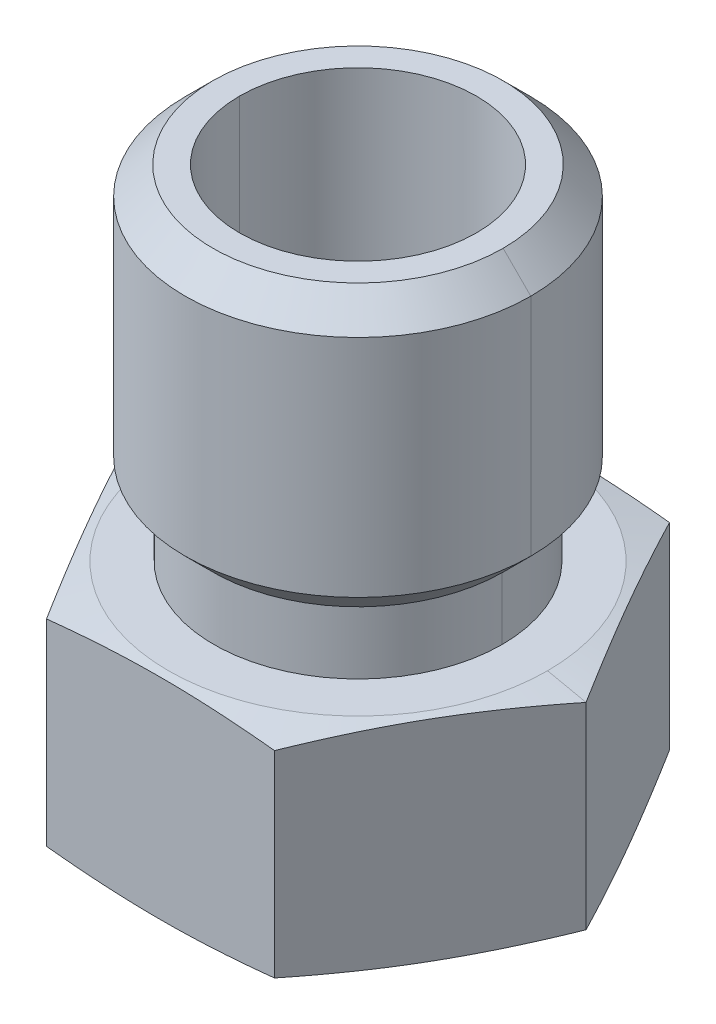
ISO-10303-21;
HEADER;
FILE_DESCRIPTION(('STEP AP214'),'2;1');
FILE_NAME('part.step','',(''),(''),'','','');
FILE_SCHEMA(('AUTOMOTIVE_DESIGN { 1 0 10303 214 1 1 1 1 }'));
ENDSEC;
DATA;
#1=APPLICATION_CONTEXT('core data for automotive mechanical design processes');
#2=APPLICATION_PROTOCOL_DEFINITION('international standard','automotive_design',2000,#1);
#3=PRODUCT_CONTEXT('',#1,'mechanical');
#4=PRODUCT('Part','Part','',(#3));
#5=PRODUCT_RELATED_PRODUCT_CATEGORY('part','',(#4));
#6=PRODUCT_DEFINITION_FORMATION('','',#4);
#7=PRODUCT_DEFINITION_CONTEXT('part definition',#1,'design');
#8=PRODUCT_DEFINITION('design','',#6,#7);
#9=PRODUCT_DEFINITION_SHAPE('','',#8);
#10=(LENGTH_UNIT() NAMED_UNIT(*) SI_UNIT(.MILLI.,.METRE.));
#11=(NAMED_UNIT(*) PLANE_ANGLE_UNIT() SI_UNIT($,.RADIAN.));
#12=(NAMED_UNIT(*) SI_UNIT($,.STERADIAN.) SOLID_ANGLE_UNIT());
#13=UNCERTAINTY_MEASURE_WITH_UNIT(LENGTH_MEASURE(1.E-05),#10,'distance_accuracy_value','');
#14=(GEOMETRIC_REPRESENTATION_CONTEXT(3) GLOBAL_UNCERTAINTY_ASSIGNED_CONTEXT((#13)) GLOBAL_UNIT_ASSIGNED_CONTEXT((#10,
#11,#12)) REPRESENTATION_CONTEXT('',''));
#15=CARTESIAN_POINT('',(0.,0.,0.));
#16=DIRECTION('',(0.,0.,1.));
#17=DIRECTION('',(1.,0.,0.));
#18=AXIS2_PLACEMENT_3D('',#15,#16,#17);
#19=CARTESIAN_POINT('',(0.,0.,0.));
#20=DIRECTION('',(0.,1.,0.));
#21=DIRECTION('',(0.,0.,1.));
#22=AXIS2_PLACEMENT_3D('',#19,#20,#21);
#23=PLANE('',#22);
#24=CARTESIAN_POINT('',(0.,0.,0.));
#25=DIRECTION('',(0.,1.,0.));
#26=DIRECTION('',(0.,0.,1.));
#27=AXIS2_PLACEMENT_3D('',#24,#25,#26);
#28=CIRCLE('',#27,6.09600000001365);
#29=CARTESIAN_POINT('',(6.09600000001365,0.,0.));
#30=VERTEX_POINT('',#29);
#31=CARTESIAN_POINT('',(-6.09600000001365,0.,0.));
#32=VERTEX_POINT('',#31);
#33=EDGE_CURVE('E146',#30,#32,#28,.T.);
#34=ORIENTED_EDGE('',*,*,#33,.F.);
#35=CARTESIAN_POINT('',(0.,0.,0.));
#36=DIRECTION('',(0.,1.,0.));
#37=DIRECTION('',(0.,0.,1.));
#38=AXIS2_PLACEMENT_3D('',#35,#36,#37);
#39=CIRCLE('',#38,6.09600000001365);
#40=EDGE_CURVE('E20',#32,#30,#39,.T.);
#41=ORIENTED_EDGE('',*,*,#40,.F.);
#42=EDGE_LOOP('',(#34,#41));
#43=FACE_BOUND('',#42,.T.);
#44=ADVANCED_FACE('F17',(#43),#23,.F.);
#45=CARTESIAN_POINT('',(0.,0.264370732722341,0.));
#46=DIRECTION('',(0.,1.,0.));
#47=DIRECTION('',(0.,0.,1.));
#48=AXIS2_PLACEMENT_3D('',#45,#46,#47);
#49=CONICAL_SURFACE('',#48,7.33976650923296,1.36135681655376);
#50=DIRECTION('',(0.978147600733752,-0.207911690818011,0.));
#51=VECTOR('',#50,1.);
#52=CARTESIAN_POINT('',(-499000.,106064.428528675,-6.11098752774529E-11));
#53=LINE('',#52,#51);
#54=CARTESIAN_POINT('',(-7.3323484187056,0.26279396890061,0.));
#55=VERTEX_POINT('',#54);
#56=EDGE_CURVE('E144',#32,#55,#53,.F.);
#57=ORIENTED_EDGE('',*,*,#56,.F.);
#58=ORIENTED_EDGE('',*,*,#40,.T.);
#59=DIRECTION('',(-0.978147600733752,-0.207911690818011,0.));
#60=VECTOR('',#59,1.);
#61=CARTESIAN_POINT('',(499000.,106064.428528675,0.));
#62=LINE('',#61,#60);
#63=CARTESIAN_POINT('',(7.33234841870554,0.26279396890061,0.));
#64=VERTEX_POINT('',#63);
#65=EDGE_CURVE('E141',#64,#30,#62,.T.);
#66=ORIENTED_EDGE('',*,*,#65,.F.);
#67=CARTESIAN_POINT('',(3.66617420935393,0.262793968906226,6.35000000000005));
#68=CARTESIAN_POINT('',(3.81860909044665,0.230380057867881,6.08597504110175));
#69=CARTESIAN_POINT('',(3.97121898596925,0.200980135804144,5.82164694831884));
#70=CARTESIAN_POINT('',(4.27677822478303,0.149358848003368,5.29240282197133));
#71=CARTESIAN_POINT('',(4.42972764347914,0.127139280960557,5.02748665780154));
#72=CARTESIAN_POINT('',(4.73538036004834,0.091105451516797,4.49808062323226));
#73=CARTESIAN_POINT('',(4.88808283674924,0.0772640455212066,4.23359217514473));
#74=CARTESIAN_POINT('',(5.19361065816769,0.0587065460036978,3.70440246532216));
#75=CARTESIAN_POINT('',(5.34643598609972,0.0539893666617372,3.43970123266052));
#76=CARTESIAN_POINT('',(5.65208664196379,0.0539893666617655,2.91029876733723));
#77=CARTESIAN_POINT('',(5.80491196989582,0.0587065460037544,2.64559753467558));
#78=CARTESIAN_POINT('',(6.11043979131427,0.0772640455213181,2.11640782485302));
#79=CARTESIAN_POINT('',(6.26314226801516,0.091105451516935,1.85191937676548));
#80=CARTESIAN_POINT('',(6.56879498458436,0.127139280960745,1.32251334219621));
#81=CARTESIAN_POINT('',(6.72174440328047,0.149358848003579,1.05759717802642));
#82=CARTESIAN_POINT('',(7.02730364209425,0.200980135804399,0.528353051678914));
#83=CARTESIAN_POINT('',(7.17991353761685,0.230380057868155,0.264024958896007));
#84=CARTESIAN_POINT('',(7.33234841870957,0.262793968906519,-2.29595956689995E-12));
#85=B_SPLINE_CURVE_WITH_KNOTS('',3,(#67,#68,#69,#70,#71,#72,#73,#74,#75,#76,#77,#78,#79,#80,#81,
#82,#83,#84),.UNSPECIFIED.,.F.,.F.,(4,2,2,2,2,2,2,2,4),(0.,0.919793548057206,1.83981732806981,
2.75684423159208,3.6737619984713,4.59067976535052,5.50770666887279,6.42773044888539,
7.3475239969426),.UNSPECIFIED.);
#86=CARTESIAN_POINT('',(3.66617420935398,0.262793968906227,6.35000000000003));
#87=VERTEX_POINT('',#86);
#88=EDGE_CURVE('E271',#87,#64,#85,.T.);
#89=ORIENTED_EDGE('',*,*,#88,.F.);
#90=CARTESIAN_POINT('',(-3.66617420935393,0.262793968906216,6.35));
#91=CARTESIAN_POINT('',(-3.36130444716862,0.230380057867886,6.35));
#92=CARTESIAN_POINT('',(-3.05608465612356,0.200980135804163,6.35));
#93=CARTESIAN_POINT('',(-2.44496617849628,0.149358848003406,6.35));
#94=CARTESIAN_POINT('',(-2.13906734110419,0.127139280960602,6.35));
#95=CARTESIAN_POINT('',(-1.52776190796608,0.0911054515168472,6.35));
#96=CARTESIAN_POINT('',(-1.22235695456443,0.0772640455212557,6.35));
#97=CARTESIAN_POINT('',(-0.611301311727807,0.0587065460037361,6.35));
#98=CARTESIAN_POINT('',(-0.305650655863879,0.0539893666617659,6.35));
#99=CARTESIAN_POINT('',(0.305650655863977,0.0539893666617669,6.35));
#100=CARTESIAN_POINT('',(0.611301311727905,0.0587065460037381,6.35));
#101=CARTESIAN_POINT('',(1.22235695456453,0.0772640455212596,6.35));
#102=CARTESIAN_POINT('',(1.52776190796617,0.0911054515168521,6.35));
#103=CARTESIAN_POINT('',(2.13906734110429,0.127139280960608,6.35));
#104=CARTESIAN_POINT('',(2.44496617849638,0.149358848003413,6.35));
#105=CARTESIAN_POINT('',(3.05608465612366,0.200980135804171,6.35));
#106=CARTESIAN_POINT('',(3.36130444716872,0.230380057867896,6.35));
#107=CARTESIAN_POINT('',(3.66617420935402,0.262793968906227,6.35));
#108=B_SPLINE_CURVE_WITH_KNOTS('',3,(#90,#91,#92,#93,#94,#95,#96,#97,#98,#99,#100,#101,#102,
#103,#104,#105,#106,#107),.UNSPECIFIED.,.F.,.F.,(4,2,2,2,2,2,2,2,4),(0.,0.919793548056815,
1.83981732806903,2.75684423159091,3.67376199846974,4.59067976534857,5.50770666887046,
6.42773044888267,7.34752399693949),.UNSPECIFIED.);
#109=CARTESIAN_POINT('',(-3.6661742093538,0.262793968906196,6.34999999999996));
#110=VERTEX_POINT('',#109);
#111=EDGE_CURVE('E329',#110,#87,#108,.T.);
#112=ORIENTED_EDGE('',*,*,#111,.F.);
#113=CARTESIAN_POINT('',(-7.33234841870939,0.26279396890648,-2.54832020853691E-12));
#114=CARTESIAN_POINT('',(-7.17991353761667,0.230380057868114,0.26402495889576));
#115=CARTESIAN_POINT('',(-7.02730364209406,0.200980135804356,0.528353051678673));
#116=CARTESIAN_POINT('',(-6.72174440328028,0.149358848003531,1.05759717802619));
#117=CARTESIAN_POINT('',(-6.56879498458417,0.127139280960695,1.32251334219598));
#118=CARTESIAN_POINT('',(-6.26314226801496,0.0911054515168808,1.85191937676526));
#119=CARTESIAN_POINT('',(-6.11043979131407,0.0772640455212621,2.1164078248528));
#120=CARTESIAN_POINT('',(-5.80491196989561,0.0587065460036958,2.64559753467538));
#121=CARTESIAN_POINT('',(-5.65208664196358,0.0539893666617059,2.91029876733703));
#122=CARTESIAN_POINT('',(-5.3464359860995,0.0539893666616763,3.43970123266033));
#123=CARTESIAN_POINT('',(-5.19361065816747,0.0587065460036367,3.70440246532198));
#124=CARTESIAN_POINT('',(-4.88808283674901,0.0772640455211458,4.23359217514455));
#125=CARTESIAN_POINT('',(-4.73538036004811,0.0911054515167367,4.4980806232321));
#126=CARTESIAN_POINT('',(-4.42972764347891,0.127139280960498,5.02748665780138));
#127=CARTESIAN_POINT('',(-4.27677822478279,0.14935884800331,5.29240282197117));
#128=CARTESIAN_POINT('',(-3.97121898596901,0.200980135804089,5.82164694831869));
#129=CARTESIAN_POINT('',(-3.81860909044641,0.230380057867828,6.08597504110161));
#130=CARTESIAN_POINT('',(-3.66617420935368,0.262793968906175,6.34999999999992));
#131=B_SPLINE_CURVE_WITH_KNOTS('',3,(#113,#114,#115,#116,#117,#118,#119,#120,#121,#122,#123,
#124,#125,#126,#127,#128,#129,#130),.UNSPECIFIED.,.F.,.F.,(4,2,2,2,2,2,2,2,4),(0.,
0.919793548057223,1.83981732806984,2.75684423159213,3.67376199847137,4.5906797653506,
5.50770666887289,6.42773044888551,7.34752399694273),.UNSPECIFIED.);
#132=EDGE_CURVE('E148',#55,#110,#131,.T.);
#133=ORIENTED_EDGE('',*,*,#132,.F.);
#134=EDGE_LOOP('',(#57,#58,#66,#89,#112,#133));
#135=FACE_BOUND('',#134,.T.);
#136=ADVANCED_FACE('F138',(#135),#49,.T.);
#137=CARTESIAN_POINT('',(0.,0.264370732722341,0.));
#138=DIRECTION('',(0.,1.,0.));
#139=DIRECTION('',(0.,0.,1.));
#140=AXIS2_PLACEMENT_3D('',#137,#138,#139);
#141=CONICAL_SURFACE('',#140,7.33976650923296,1.36135681655376);
#142=ORIENTED_EDGE('',*,*,#65,.T.);
#143=ORIENTED_EDGE('',*,*,#33,.T.);
#144=ORIENTED_EDGE('',*,*,#56,.T.);
#145=CARTESIAN_POINT('',(-3.66617420935393,0.262793968906227,-6.35000000000006));
#146=CARTESIAN_POINT('',(-3.81860909044665,0.230380057867881,-6.08597504110175));
#147=CARTESIAN_POINT('',(-3.97121898596925,0.200980135804144,-5.82164694831884));
#148=CARTESIAN_POINT('',(-4.27677822478303,0.149358848003368,-5.29240282197133));
#149=CARTESIAN_POINT('',(-4.42972764347914,0.127139280960557,-5.02748665780154));
#150=CARTESIAN_POINT('',(-4.73538036004834,0.0911054515167971,-4.49808062323227));
#151=CARTESIAN_POINT('',(-4.88808283674923,0.0772640455212065,-4.23359217514473));
#152=CARTESIAN_POINT('',(-5.19361065816769,0.0587065460036977,-3.70440246532216));
#153=CARTESIAN_POINT('',(-5.34643598609972,0.0539893666617373,-3.43970123266052));
#154=CARTESIAN_POINT('',(-5.65208664196379,0.0539893666617656,-2.91029876733723));
#155=CARTESIAN_POINT('',(-5.80491196989582,0.0587065460037543,-2.64559753467558));
#156=CARTESIAN_POINT('',(-6.11043979131427,0.0772640455213179,-2.11640782485302));
#157=CARTESIAN_POINT('',(-6.26314226801516,0.0911054515169349,-1.85191937676548));
#158=CARTESIAN_POINT('',(-6.56879498458436,0.127139280960745,-1.32251334219621));
#159=CARTESIAN_POINT('',(-6.72174440328047,0.149358848003579,-1.05759717802643));
#160=CARTESIAN_POINT('',(-7.02730364209425,0.200980135804399,-0.528353051678916));
#161=CARTESIAN_POINT('',(-7.17991353761685,0.230380057868155,-0.264024958896009));
#162=CARTESIAN_POINT('',(-7.33234841870957,0.262793968906519,2.29488033074503E-12));
#163=B_SPLINE_CURVE_WITH_KNOTS('',3,(#145,#146,#147,#148,#149,#150,#151,#152,#153,#154,#155,
#156,#157,#158,#159,#160,#161,#162),.UNSPECIFIED.,.F.,.F.,(4,2,2,2,2,2,2,2,4),(0.,
0.919793548057207,1.83981732806981,2.75684423159208,3.6737619984713,4.59067976535052,
5.50770666887279,6.42773044888539,7.3475239969426),.UNSPECIFIED.);
#164=CARTESIAN_POINT('',(-3.66617420935398,0.262793968906227,-6.35000000000003));
#165=VERTEX_POINT('',#164);
#166=EDGE_CURVE('E240',#165,#55,#163,.T.);
#167=ORIENTED_EDGE('',*,*,#166,.F.);
#168=CARTESIAN_POINT('',(3.66617420935393,0.262793968906216,-6.35));
#169=CARTESIAN_POINT('',(3.36130444716862,0.230380057867886,-6.35));
#170=CARTESIAN_POINT('',(3.05608465612356,0.200980135804163,-6.35));
#171=CARTESIAN_POINT('',(2.44496617849628,0.149358848003406,-6.35));
#172=CARTESIAN_POINT('',(2.13906734110419,0.127139280960602,-6.35));
#173=CARTESIAN_POINT('',(1.52776190796608,0.0911054515168472,-6.35));
#174=CARTESIAN_POINT('',(1.22235695456443,0.0772640455212557,-6.35));
#175=CARTESIAN_POINT('',(0.611301311727807,0.0587065460037361,-6.35));
#176=CARTESIAN_POINT('',(0.305650655863879,0.0539893666617659,-6.35));
#177=CARTESIAN_POINT('',(-0.305650655863977,0.0539893666617669,-6.35));
#178=CARTESIAN_POINT('',(-0.611301311727905,0.0587065460037381,-6.35));
#179=CARTESIAN_POINT('',(-1.22235695456453,0.0772640455212596,-6.35));
#180=CARTESIAN_POINT('',(-1.52776190796617,0.0911054515168521,-6.35));
#181=CARTESIAN_POINT('',(-2.13906734110429,0.127139280960608,-6.35));
#182=CARTESIAN_POINT('',(-2.44496617849638,0.149358848003413,-6.35));
#183=CARTESIAN_POINT('',(-3.05608465612366,0.200980135804171,-6.35));
#184=CARTESIAN_POINT('',(-3.36130444716872,0.230380057867896,-6.35));
#185=CARTESIAN_POINT('',(-3.66617420935402,0.262793968906227,-6.35));
#186=B_SPLINE_CURVE_WITH_KNOTS('',3,(#168,#169,#170,#171,#172,#173,#174,#175,#176,#177,#178,
#179,#180,#181,#182,#183,#184,#185),.UNSPECIFIED.,.F.,.F.,(4,2,2,2,2,2,2,2,4),(0.,
0.919793548056815,1.83981732806903,2.75684423159091,3.67376199846974,4.59067976534857,
5.50770666887046,6.42773044888267,7.34752399693949),.UNSPECIFIED.);
#187=CARTESIAN_POINT('',(3.6661742093538,0.262793968906196,-6.34999999999996));
#188=VERTEX_POINT('',#187);
#189=EDGE_CURVE('E252',#188,#165,#186,.T.);
#190=ORIENTED_EDGE('',*,*,#189,.F.);
#191=CARTESIAN_POINT('',(7.33234841870937,0.262793968906476,2.51239042590781E-12));
#192=CARTESIAN_POINT('',(7.17991353761665,0.23038005786811,-0.264024958895795));
#193=CARTESIAN_POINT('',(7.02730364209405,0.200980135804352,-0.528353051678706));
#194=CARTESIAN_POINT('',(6.72174440328027,0.149358848003528,-1.05759717802622));
#195=CARTESIAN_POINT('',(6.56879498458415,0.127139280960692,-1.32251334219601));
#196=CARTESIAN_POINT('',(6.26314226801495,0.0911054515168794,-1.85191937676529));
#197=CARTESIAN_POINT('',(6.11043979131406,0.0772640455212611,-2.11640782485283));
#198=CARTESIAN_POINT('',(5.8049119698956,0.0587065460036954,-2.6455975346754));
#199=CARTESIAN_POINT('',(5.65208664196357,0.0539893666617059,-2.91029876733705));
#200=CARTESIAN_POINT('',(5.34643598609949,0.0539893666616767,-3.43970123266034));
#201=CARTESIAN_POINT('',(5.19361065816746,0.058706546003637,-3.70440246532199));
#202=CARTESIAN_POINT('',(4.888082836749,0.0772640455211462,-4.23359217514457));
#203=CARTESIAN_POINT('',(4.73538036004811,0.0911054515167373,-4.49808062323211));
#204=CARTESIAN_POINT('',(4.42972764347891,0.127139280960499,-5.02748665780139));
#205=CARTESIAN_POINT('',(4.27677822478279,0.149358848003311,-5.29240282197118));
#206=CARTESIAN_POINT('',(3.97121898596901,0.20098013580409,-5.8216469483187));
#207=CARTESIAN_POINT('',(3.8186090904464,0.230380057867828,-6.08597504110161));
#208=CARTESIAN_POINT('',(3.66617420935368,0.262793968906175,-6.34999999999992));
#209=B_SPLINE_CURVE_WITH_KNOTS('',3,(#191,#192,#193,#194,#195,#196,#197,#198,#199,#200,#201,
#202,#203,#204,#205,#206,#207,#208),.UNSPECIFIED.,.F.,.F.,(4,2,2,2,2,2,2,2,4),(0.,
0.919793548057218,1.83981732806983,2.75684423159212,3.67376199847134,4.59067976535057,
5.50770666887286,6.42773044888547,7.3475239969427),.UNSPECIFIED.);
#210=EDGE_CURVE('E152',#64,#188,#209,.T.);
#211=ORIENTED_EDGE('',*,*,#210,.F.);
#212=EDGE_LOOP('',(#142,#143,#144,#167,#190,#211));
#213=FACE_BOUND('',#212,.T.);
#214=ADVANCED_FACE('F150',(#213),#141,.T.);
#215=CARTESIAN_POINT('',(0.,6.731,0.));
#216=DIRECTION('',(0.,-1.,0.));
#217=DIRECTION('',(0.,0.,-1.));
#218=AXIS2_PLACEMENT_3D('',#215,#216,#217);
#219=PLANE('',#218);
#220=CARTESIAN_POINT('',(0.,6.731,0.));
#221=DIRECTION('',(0.,-1.,0.));
#222=DIRECTION('',(0.,0.,-1.));
#223=AXIS2_PLACEMENT_3D('',#220,#221,#222);
#224=CIRCLE('',#223,2.54);
#225=CARTESIAN_POINT('',(-2.54,6.731,0.));
#226=VERTEX_POINT('',#225);
#227=CARTESIAN_POINT('',(2.54,6.731,0.));
#228=VERTEX_POINT('',#227);
#229=EDGE_CURVE('E250',#226,#228,#224,.F.);
#230=ORIENTED_EDGE('',*,*,#229,.T.);
#231=CARTESIAN_POINT('',(0.,6.731,0.));
#232=DIRECTION('',(0.,-1.,0.));
#233=DIRECTION('',(0.,0.,-1.));
#234=AXIS2_PLACEMENT_3D('',#231,#232,#233);
#235=CIRCLE('',#234,2.54);
#236=EDGE_CURVE('E316',#228,#226,#235,.F.);
#237=ORIENTED_EDGE('',*,*,#236,.T.);
#238=EDGE_LOOP('',(#230,#237));
#239=FACE_BOUND('',#238,.T.);
#240=ADVANCED_FACE('F260',(#239),#219,.F.);
#241=CARTESIAN_POINT('',(-7.33234841870792,0.,0.));
#242=DIRECTION('',(-0.866025403784429,0.,0.500000000000017));
#243=DIRECTION('',(0.500000000000017,0.,0.866025403784429));
#244=AXIS2_PLACEMENT_3D('',#241,#242,#243);
#245=PLANE('',#244);
#246=DIRECTION('',(0.,1.,0.));
#247=VECTOR('',#246,1.);
#248=CARTESIAN_POINT('',(-3.66617420935396,0.,6.35));
#249=LINE('',#248,#247);
#250=CARTESIAN_POINT('',(-3.66617423298878,6.59520602859016,6.35));
#251=VERTEX_POINT('',#250);
#252=EDGE_CURVE('E328',#251,#110,#249,.F.);
#253=ORIENTED_EDGE('',*,*,#252,.F.);
#254=CARTESIAN_POINT('',(-7.33234841870765,6.59520603110214,4.57986680926984E-13));
#255=CARTESIAN_POINT('',(-7.17991353966322,6.62761994170392,0.264024955351029));
#256=CARTESIAN_POINT('',(-7.02730364619408,6.65701986341339,0.52835304457723));
#257=CARTESIAN_POINT('',(-6.72174441149638,6.70864115071417,1.0575971637955));
#258=CARTESIAN_POINT('',(-6.56879499486288,6.73086071761135,1.32251332439273));
#259=CARTESIAN_POINT('',(-6.26314228240563,6.76689454701844,1.85191935183991));
#260=CARTESIAN_POINT('',(-6.11043980775404,6.78073595312156,2.11640779637794));
#261=CARTESIAN_POINT('',(-5.80491199043189,6.79929345312371,2.6455974991055));
#262=CARTESIAN_POINT('',(-5.65208666454685,6.80401063284272,2.91029872822164));
#263=CARTESIAN_POINT('',(-5.34643601276322,6.80401063385039,3.43970118647741));
#264=CARTESIAN_POINT('',(-5.19361068686462,6.79929345513872,3.70440241561705));
#265=CARTESIAN_POINT('',(-4.88808286950178,6.78073595708601,4.23359211841509));
#266=CARTESIAN_POINT('',(-4.73538039482306,6.76689455192502,4.49808056300012));
#267=CARTESIAN_POINT('',(-4.42972768230323,6.7308607242934,5.0274865905557));
#268=CARTESIAN_POINT('',(-4.27677826563424,6.70864115822925,5.29240275121439));
#269=CARTESIAN_POINT('',(-3.97121903086039,6.65701987246774,5.82164687056454));
#270=CARTESIAN_POINT('',(-3.81860913735061,6.62761995146447,6.08597495986115));
#271=CARTESIAN_POINT('',(-3.66617425826617,6.59520604149874,6.34999991528101));
#272=B_SPLINE_CURVE_WITH_KNOTS('',3,(#254,#255,#256,#257,#258,#259,#260,#261,#262,#263,#264,
#265,#266,#267,#268,#269,#270,#271),.UNSPECIFIED.,.F.,.F.,(4,2,2,2,2,2,2,2,4),(0.,
0.919793535696101,1.83981730333802,2.75684419459774,3.67376194922013,4.59067970387622,
5.50770659516791,6.42773036283809,7.34752389857076),.UNSPECIFIED.);
#273=CARTESIAN_POINT('',(-7.3323484187056,6.59520603110491,0.));
#274=VERTEX_POINT('',#273);
#275=EDGE_CURVE('E310',#274,#251,#272,.T.);
#276=ORIENTED_EDGE('',*,*,#275,.F.);
#277=DIRECTION('',(0.,1.,0.));
#278=VECTOR('',#277,1.);
#279=CARTESIAN_POINT('',(-7.33234841870817,0.,-1.40512601554121E-13));
#280=LINE('',#279,#278);
#281=EDGE_CURVE('E248',#55,#274,#280,.T.);
#282=ORIENTED_EDGE('',*,*,#281,.F.);
#283=ORIENTED_EDGE('',*,*,#132,.T.);
#284=EDGE_LOOP('',(#253,#276,#282,#283));
#285=FACE_BOUND('',#284,.T.);
#286=ADVANCED_FACE('F317',(#285),#245,.T.);
#287=CARTESIAN_POINT('',(-3.66617420935396,0.,6.35));
#288=DIRECTION('',(0.,0.,1.));
#289=DIRECTION('',(1.,0.,0.));
#290=AXIS2_PLACEMENT_3D('',#287,#288,#289);
#291=PLANE('',#290);
#292=DIRECTION('',(0.,1.,0.));
#293=VECTOR('',#292,1.);
#294=CARTESIAN_POINT('',(3.66617420935396,0.,6.35));
#295=LINE('',#294,#293);
#296=CARTESIAN_POINT('',(3.66617419753657,6.59520602859016,6.35000002046833));
#297=VERTEX_POINT('',#296);
#298=EDGE_CURVE('E333',#297,#87,#295,.F.);
#299=ORIENTED_EDGE('',*,*,#298,.F.);
#300=CARTESIAN_POINT('',(-3.66617425662359,6.59520602607829,6.35));
#301=CARTESIAN_POINT('',(-3.36130449659395,6.62761993719836,6.35));
#302=CARTESIAN_POINT('',(-3.05608470771054,6.65701985942026,6.35));
#303=CARTESIAN_POINT('',(-2.44496623441101,6.70864114770643,6.35));
#304=CARTESIAN_POINT('',(-2.13906739918502,6.7308607150765,6.35));
#305=CARTESIAN_POINT('',(-1.52776197035729,6.76689454535923,6.35));
#306=CARTESIAN_POINT('',(-1.22235701909993,6.78073595186564,6.35));
#307=CARTESIAN_POINT('',(-0.611301380536359,6.79929345257561,6.35));
#308=CARTESIAN_POINT('',(-0.305650726801214,6.80401063259918,6.35));
#309=CARTESIAN_POINT('',(0.30565058070931,6.80401063409378,6.35));
#310=CARTESIAN_POINT('',(0.61130123448469,6.7992934555643,6.35));
#311=CARTESIAN_POINT('',(1.22235687316897,6.78073595774577,6.35));
#312=CARTESIAN_POINT('',(1.52776182450682,6.76689455263674,6.35));
#313=CARTESIAN_POINT('',(2.13906725352021,6.73086072498741,6.35));
#314=CARTESIAN_POINT('',(2.44496608885145,6.70864115885289,6.35));
#315=CARTESIAN_POINT('',(3.05608456237684,6.65701987284979,6.35));
#316=CARTESIAN_POINT('',(3.36130435138085,6.62761995167535,6.35));
#317=CARTESIAN_POINT('',(3.66617411152915,6.59520604149868,6.35));
#318=B_SPLINE_CURVE_WITH_KNOTS('',3,(#300,#301,#302,#303,#304,#305,#306,#307,#308,#309,#310,
#311,#312,#313,#314,#315,#316,#317),.UNSPECIFIED.,.F.,.F.,(4,2,2,2,2,2,2,2,4),(0.,
0.919793541651234,1.83981731525694,2.75684421242639,3.67376197295492,4.59067973353343,
5.50770663075031,6.42773040439792,7.3475239461034),.UNSPECIFIED.);
#319=EDGE_CURVE('E298',#251,#297,#318,.T.);
#320=ORIENTED_EDGE('',*,*,#319,.F.);
#321=ORIENTED_EDGE('',*,*,#252,.T.);
#322=ORIENTED_EDGE('',*,*,#111,.T.);
#323=EDGE_LOOP('',(#299,#320,#321,#322));
#324=FACE_BOUND('',#323,.T.);
#325=ADVANCED_FACE('F320',(#324),#291,.T.);
#326=CARTESIAN_POINT('',(3.66617420935396,0.,6.35));
#327=DIRECTION('',(0.866025403784429,0.,0.500000000000017));
#328=DIRECTION('',(0.500000000000017,0.,-0.866025403784429));
#329=AXIS2_PLACEMENT_3D('',#326,#327,#328);
#330=PLANE('',#329);
#331=DIRECTION('',(0.,1.,0.));
#332=VECTOR('',#331,1.);
#333=CARTESIAN_POINT('',(7.33234841870792,0.,0.));
#334=LINE('',#333,#332);
#335=CARTESIAN_POINT('',(7.33234841871646,6.59520603110216,-2.46759502394645E-13));
#336=VERTEX_POINT('',#335);
#337=EDGE_CURVE('E270',#336,#64,#334,.F.);
#338=ORIENTED_EDGE('',*,*,#337,.F.);
#339=CARTESIAN_POINT('',(3.66617418571917,6.5952060260783,6.35000004093666));
#340=CARTESIAN_POINT('',(3.8186090677822,6.62761993763491,6.08597508035773));
#341=CARTESIAN_POINT('',(3.9712189642773,6.65701986021106,5.82164698589041));
#342=CARTESIAN_POINT('',(4.27677820504298,6.70864114899719,5.2924028561621));
#343=CARTESIAN_POINT('',(4.42972762471851,6.73086071651289,5.02748669029592));
#344=CARTESIAN_POINT('',(4.73538034324416,6.76689454683228,4.49808065233796));
#345=CARTESIAN_POINT('',(4.88808282092207,6.78073595323116,4.23359220255818));
#346=CARTESIAN_POINT('',(5.19361064430001,6.7992934534565,3.70440248934169));
#347=CARTESIAN_POINT('',(5.3464359732145,6.80401063310303,3.43970125497837));
#348=CARTESIAN_POINT('',(5.65208663105004,6.80401063358996,2.91029878624038));
#349=CARTESIAN_POINT('',(5.80491195997109,6.79929345443018,2.64559755186571));
#350=CARTESIAN_POINT('',(6.11043978336869,6.78073595514685,2.11640783861517));
#351=CARTESIAN_POINT('',(6.26314226105971,6.76689454920322,1.85191938881268));
#352=CARTESIAN_POINT('',(6.56879497961561,6.73086071974175,1.32251335080233));
#353=CARTESIAN_POINT('',(6.72174439930828,6.70864115262859,1.05759718490646));
#354=CARTESIAN_POINT('',(7.02730364011076,6.65701986458625,0.528353055114429));
#355=CARTESIAN_POINT('',(7.1799135366255,6.62761994235136,0.264024960613082));
#356=CARTESIAN_POINT('',(7.33234841870786,6.59520603110209,6.747819950172E-13));
#357=B_SPLINE_CURVE_WITH_KNOTS('',3,(#339,#340,#341,#342,#343,#344,#345,#346,#347,#348,#349,
#350,#351,#352,#353,#354,#355,#356),.UNSPECIFIED.,.F.,.F.,(4,2,2,2,2,2,2,2,4),(0.,
0.919793554011846,1.83981733998773,2.75684424941925,3.67376202220412,4.59067979500526,
5.50770670445223,6.42773049044177,7.34752404447129),.UNSPECIFIED.);
#358=EDGE_CURVE('E292',#297,#336,#357,.T.);
#359=ORIENTED_EDGE('',*,*,#358,.F.);
#360=ORIENTED_EDGE('',*,*,#298,.T.);
#361=ORIENTED_EDGE('',*,*,#88,.T.);
#362=EDGE_LOOP('',(#338,#359,#360,#361));
#363=FACE_BOUND('',#362,.T.);
#364=ADVANCED_FACE('F280',(#363),#330,.T.);
#365=CARTESIAN_POINT('',(7.33234841870792,0.,0.));
#366=DIRECTION('',(0.866025403784429,0.,-0.500000000000017));
#367=DIRECTION('',(-0.500000000000017,0.,-0.866025403784429));
#368=AXIS2_PLACEMENT_3D('',#365,#366,#367);
#369=PLANE('',#368);
#370=DIRECTION('',(0.,1.,0.));
#371=VECTOR('',#370,1.);
#372=CARTESIAN_POINT('',(3.66617420935396,0.,-6.35));
#373=LINE('',#372,#371);
#374=CARTESIAN_POINT('',(3.66617423298286,6.59520602859079,-6.35));
#375=VERTEX_POINT('',#374);
#376=EDGE_CURVE('E269',#375,#188,#373,.F.);
#377=ORIENTED_EDGE('',*,*,#376,.F.);
#378=CARTESIAN_POINT('',(7.33234841870764,6.59520603110214,-4.9307002024208E-13));
#379=CARTESIAN_POINT('',(7.17991353966345,6.62761994170387,-0.264024955350633));
#380=CARTESIAN_POINT('',(7.02730364619456,6.6570198634133,-0.528353044576402));
#381=CARTESIAN_POINT('',(6.72174441149736,6.70864115071402,-1.0575971637938));
#382=CARTESIAN_POINT('',(6.5687949948641,6.73086071761118,-1.3225133243906));
#383=CARTESIAN_POINT('',(6.26314228240735,6.76689454701826,-1.85191935183691));
#384=CARTESIAN_POINT('',(6.11043980775601,6.78073595312139,-2.11640779637452));
#385=CARTESIAN_POINT('',(5.80491199043436,6.7992934531236,-2.64559749910122));
#386=CARTESIAN_POINT('',(5.65208666454958,6.80401063284266,-2.91029872821693));
#387=CARTESIAN_POINT('',(5.34643601276644,6.80401063385045,-3.43970118647184));
#388=CARTESIAN_POINT('',(5.19361068686809,6.79929345513886,-3.70440241561105));
#389=CARTESIAN_POINT('',(4.88808286950574,6.78073595708632,-4.23359211840824));
#390=CARTESIAN_POINT('',(4.73538039482726,6.76689455192543,-4.49808056299284));
#391=CARTESIAN_POINT('',(4.42972768230792,6.73086072429404,-5.02748659054757));
#392=CARTESIAN_POINT('',(4.27677826563918,6.70864115823,-5.29240275120583));
#393=CARTESIAN_POINT('',(3.97121903086582,6.65701987246874,-5.82164687055513));
#394=CARTESIAN_POINT('',(3.81860913735628,6.6276199514656,-6.08597495985132));
#395=CARTESIAN_POINT('',(3.66617425827209,6.5952060415,-6.34999991527075));
#396=B_SPLINE_CURVE_WITH_KNOTS('',3,(#378,#379,#380,#381,#382,#383,#384,#385,#386,#387,#388,
#389,#390,#391,#392,#393,#394,#395),.UNSPECIFIED.,.F.,.F.,(4,2,2,2,2,2,2,2,4),(0.,
0.919793535694599,1.83981730333502,2.75684419459325,3.67376194921415,4.59067970386876,
5.50770659515896,6.42773036282764,7.34752389855882),.UNSPECIFIED.);
#397=EDGE_CURVE('E285',#336,#375,#396,.T.);
#398=ORIENTED_EDGE('',*,*,#397,.F.);
#399=ORIENTED_EDGE('',*,*,#337,.T.);
#400=ORIENTED_EDGE('',*,*,#210,.T.);
#401=EDGE_LOOP('',(#377,#398,#399,#400));
#402=FACE_BOUND('',#401,.T.);
#403=ADVANCED_FACE('F277',(#402),#369,.T.);
#404=CARTESIAN_POINT('',(3.66617420935396,0.,-6.35));
#405=DIRECTION('',(0.,0.,-1.));
#406=DIRECTION('',(-1.,0.,0.));
#407=AXIS2_PLACEMENT_3D('',#404,#405,#406);
#408=PLANE('',#407);
#409=DIRECTION('',(0.,1.,0.));
#410=VECTOR('',#409,1.);
#411=CARTESIAN_POINT('',(-3.66617420935396,0.,-6.35));
#412=LINE('',#411,#410);
#413=CARTESIAN_POINT('',(-3.6661741975374,6.59520602859034,-6.35000002046688));
#414=VERTEX_POINT('',#413);
#415=EDGE_CURVE('E249',#414,#165,#412,.F.);
#416=ORIENTED_EDGE('',*,*,#415,.F.);
#417=CARTESIAN_POINT('',(3.66617425661175,6.59520602607955,-6.35));
#418=CARTESIAN_POINT('',(3.36130449658245,6.62761993719951,-6.35));
#419=CARTESIAN_POINT('',(3.05608470769939,6.65701985942129,-6.35));
#420=CARTESIAN_POINT('',(2.44496623440056,6.70864114770722,-6.35));
#421=CARTESIAN_POINT('',(2.13906739917493,6.73086071507718,-6.35));
#422=CARTESIAN_POINT('',(1.52776197034789,6.7668945453597,-6.35));
#423=CARTESIAN_POINT('',(1.22235701909088,6.780735951866,-6.35));
#424=CARTESIAN_POINT('',(0.611301380528014,6.79929345257577,-6.35));
#425=CARTESIAN_POINT('',(0.305650726793222,6.80401063259926,-6.35));
#426=CARTESIAN_POINT('',(-0.305650580716592,6.8040106340937,-6.35));
#427=CARTESIAN_POINT('',(-0.611301234491615,6.79929345556415,-6.35));
#428=CARTESIAN_POINT('',(-1.22235687317518,6.78073595774552,-6.35));
#429=CARTESIAN_POINT('',(-1.52776182451267,6.76689455263644,-6.35));
#430=CARTESIAN_POINT('',(-2.13906725352534,6.73086072498706,-6.35));
#431=CARTESIAN_POINT('',(-2.44496608885622,6.70864115885252,-6.35));
#432=CARTESIAN_POINT('',(-3.05608456238089,6.65701987284941,-6.35));
#433=CARTESIAN_POINT('',(-3.36130435138454,6.62761995167498,-6.35));
#434=CARTESIAN_POINT('',(-3.66617411153248,6.59520604149832,-6.35));
#435=B_SPLINE_CURVE_WITH_KNOTS('',3,(#417,#418,#419,#420,#421,#422,#423,#424,#425,#426,#427,
#428,#429,#430,#431,#432,#433,#434),.UNSPECIFIED.,.F.,.F.,(4,2,2,2,2,2,2,2,4),(0.,
0.919793541650165,1.83981731525479,2.75684421242319,3.67376197295066,4.5906797335281,
5.5077066307439,6.42773040439044,7.34752394609485),.UNSPECIFIED.);
#436=EDGE_CURVE('E218',#375,#414,#435,.T.);
#437=ORIENTED_EDGE('',*,*,#436,.F.);
#438=ORIENTED_EDGE('',*,*,#376,.T.);
#439=ORIENTED_EDGE('',*,*,#189,.T.);
#440=EDGE_LOOP('',(#416,#437,#438,#439));
#441=FACE_BOUND('',#440,.T.);
#442=ADVANCED_FACE('F233',(#441),#408,.T.);
#443=CARTESIAN_POINT('',(-3.66617420935396,0.,-6.35));
#444=DIRECTION('',(-0.866025403784429,0.,-0.500000000000017));
#445=DIRECTION('',(-0.500000000000017,0.,0.866025403784429));
#446=AXIS2_PLACEMENT_3D('',#443,#444,#445);
#447=PLANE('',#446);
#448=ORIENTED_EDGE('',*,*,#281,.T.);
#449=CARTESIAN_POINT('',(-3.66617418572084,6.59520602607865,-6.35000004093377));
#450=CARTESIAN_POINT('',(-3.8186090677838,6.62761993763523,-6.08597508035496));
#451=CARTESIAN_POINT('',(-3.97121896427883,6.65701986021134,-5.82164698588776));
#452=CARTESIAN_POINT('',(-4.27677820504437,6.7086411489974,-5.29240285615969));
#453=CARTESIAN_POINT('',(-4.42972762471983,6.73086071651307,-5.02748669029363));
#454=CARTESIAN_POINT('',(-4.73538034324535,6.7668945468324,-4.4980806523359));
#455=CARTESIAN_POINT('',(-4.88808282092319,6.78073595323125,-4.23359220255624));
#456=CARTESIAN_POINT('',(-5.19361064430098,6.79929345345653,-3.70440248934));
#457=CARTESIAN_POINT('',(-5.34643597321541,6.80401063310305,-3.4397012549768));
#458=CARTESIAN_POINT('',(-5.65208663105081,6.80401063358994,-2.91029878623905));
#459=CARTESIAN_POINT('',(-5.80491195997179,6.79929345443015,-2.6455975518645));
#460=CARTESIAN_POINT('',(-6.11043978336925,6.7807359551468,-2.1164078386142));
#461=CARTESIAN_POINT('',(-6.2631422610602,6.76689454920317,-1.85191938881183));
#462=CARTESIAN_POINT('',(-6.56879497961596,6.73086071974171,-1.32251335080173));
#463=CARTESIAN_POINT('',(-6.72174439930856,6.70864115262855,-1.05759718490598));
#464=CARTESIAN_POINT('',(-7.0273036401109,6.65701986458622,-0.528353055114184));
#465=CARTESIAN_POINT('',(-7.17991353662557,6.62761994235134,-0.264024960612958));
#466=CARTESIAN_POINT('',(-7.33234841870786,6.59520603110209,-6.72818201907247E-13));
#467=B_SPLINE_CURVE_WITH_KNOTS('',3,(#449,#450,#451,#452,#453,#454,#455,#456,#457,#458,#459,
#460,#461,#462,#463,#464,#465,#466),.UNSPECIFIED.,.F.,.F.,(4,2,2,2,2,2,2,2,4),(0.,
0.919793554011426,1.8398173399869,2.756844249418,3.67376202220244,4.59067979500317,
5.50770670444972,6.42773049043885,7.34752404446794),.UNSPECIFIED.);
#468=EDGE_CURVE('E210',#414,#274,#467,.T.);
#469=ORIENTED_EDGE('',*,*,#468,.F.);
#470=ORIENTED_EDGE('',*,*,#415,.T.);
#471=ORIENTED_EDGE('',*,*,#166,.T.);
#472=EDGE_LOOP('',(#448,#469,#470,#471));
#473=FACE_BOUND('',#472,.T.);
#474=ADVANCED_FACE('F228',(#473),#447,.T.);
#475=CARTESIAN_POINT('',(0.,11.811,0.));
#476=DIRECTION('',(0.,-1.,0.));
#477=DIRECTION('',(0.,0.,-1.));
#478=AXIS2_PLACEMENT_3D('',#475,#476,#477);
#479=CYLINDRICAL_SURFACE('',#478,2.54);
#480=ORIENTED_EDGE('',*,*,#229,.F.);
#481=DIRECTION('',(0.,-1.,0.));
#482=VECTOR('',#481,1.);
#483=CARTESIAN_POINT('',(-2.54,11.811,0.));
#484=LINE('',#483,#482);
#485=CARTESIAN_POINT('',(-2.54,11.811,0.));
#486=VERTEX_POINT('',#485);
#487=EDGE_CURVE('E315',#226,#486,#484,.F.);
#488=ORIENTED_EDGE('',*,*,#487,.T.);
#489=CARTESIAN_POINT('',(0.,11.811,0.));
#490=DIRECTION('',(0.,-1.,0.));
#491=DIRECTION('',(0.,0.,-1.));
#492=AXIS2_PLACEMENT_3D('',#489,#490,#491);
#493=CIRCLE('',#492,2.54);
#494=CARTESIAN_POINT('',(2.54,11.811,0.));
#495=VERTEX_POINT('',#494);
#496=EDGE_CURVE('E207',#486,#495,#493,.F.);
#497=ORIENTED_EDGE('',*,*,#496,.T.);
#498=DIRECTION('',(0.,-1.,0.));
#499=VECTOR('',#498,1.);
#500=CARTESIAN_POINT('',(2.54,11.811,0.));
#501=LINE('',#500,#499);
#502=EDGE_CURVE('E348',#495,#228,#501,.T.);
#503=ORIENTED_EDGE('',*,*,#502,.T.);
#504=EDGE_LOOP('',(#480,#488,#497,#503));
#505=FACE_BOUND('',#504,.T.);
#506=ADVANCED_FACE('F232',(#505),#479,.F.);
#507=CARTESIAN_POINT('',(0.,11.811,0.));
#508=DIRECTION('',(0.,-1.,0.));
#509=DIRECTION('',(0.,0.,-1.));
#510=AXIS2_PLACEMENT_3D('',#507,#508,#509);
#511=CYLINDRICAL_SURFACE('',#510,2.54);
#512=ORIENTED_EDGE('',*,*,#236,.F.);
#513=ORIENTED_EDGE('',*,*,#502,.F.);
#514=CARTESIAN_POINT('',(0.,11.811,0.));
#515=DIRECTION('',(0.,-1.,0.));
#516=DIRECTION('',(0.,0.,-1.));
#517=AXIS2_PLACEMENT_3D('',#514,#515,#516);
#518=CIRCLE('',#517,2.54);
#519=EDGE_CURVE('E204',#495,#486,#518,.F.);
#520=ORIENTED_EDGE('',*,*,#519,.T.);
#521=ORIENTED_EDGE('',*,*,#487,.F.);
#522=EDGE_LOOP('',(#512,#513,#520,#521));
#523=FACE_BOUND('',#522,.T.);
#524=ADVANCED_FACE('F306',(#523),#511,.F.);
#525=CARTESIAN_POINT('',(0.,6.59362926728591,0.));
#526=DIRECTION('',(0.,-1.,0.));
#527=DIRECTION('',(0.,0.,-1.));
#528=AXIS2_PLACEMENT_3D('',#525,#526,#527);
#529=CONICAL_SURFACE('',#528,7.33976650923296,1.36135681655376);
#530=DIRECTION('',(-0.978147600733752,0.207911690818011,0.));
#531=VECTOR('',#530,1.);
#532=CARTESIAN_POINT('',(499000.,-106057.570528675,-6.11098752774529E-11));
#533=LINE('',#532,#531);
#534=CARTESIAN_POINT('',(6.09600000001365,6.85800000000825,0.));
#535=VERTEX_POINT('',#534);
#536=EDGE_CURVE('E291',#535,#336,#533,.F.);
#537=ORIENTED_EDGE('',*,*,#536,.F.);
#538=CARTESIAN_POINT('',(0.,6.85800000000825,0.));
#539=DIRECTION('',(0.,-1.,0.));
#540=DIRECTION('',(0.,0.,-1.));
#541=AXIS2_PLACEMENT_3D('',#538,#539,#540);
#542=CIRCLE('',#541,6.09600000001365);
#543=CARTESIAN_POINT('',(-6.09600000001365,6.85800000000825,0.));
#544=VERTEX_POINT('',#543);
#545=EDGE_CURVE('E201',#544,#535,#542,.F.);
#546=ORIENTED_EDGE('',*,*,#545,.F.);
#547=DIRECTION('',(0.978147600733752,0.207911690818011,0.));
#548=VECTOR('',#547,1.);
#549=CARTESIAN_POINT('',(-499000.,-106057.570528675,0.));
#550=LINE('',#549,#548);
#551=EDGE_CURVE('E209',#274,#544,#550,.T.);
#552=ORIENTED_EDGE('',*,*,#551,.F.);
#553=ORIENTED_EDGE('',*,*,#275,.T.);
#554=ORIENTED_EDGE('',*,*,#319,.T.);
#555=ORIENTED_EDGE('',*,*,#358,.T.);
#556=EDGE_LOOP('',(#537,#546,#552,#553,#554,#555));
#557=FACE_BOUND('',#556,.T.);
#558=ADVANCED_FACE('F303',(#557),#529,.T.);
#559=CARTESIAN_POINT('',(0.,6.59362926728591,0.));
#560=DIRECTION('',(0.,-1.,0.));
#561=DIRECTION('',(0.,0.,-1.));
#562=AXIS2_PLACEMENT_3D('',#559,#560,#561);
#563=CONICAL_SURFACE('',#562,7.33976650923296,1.36135681655376);
#564=ORIENTED_EDGE('',*,*,#551,.T.);
#565=CARTESIAN_POINT('',(0.,6.85800000000825,0.));
#566=DIRECTION('',(0.,-1.,0.));
#567=DIRECTION('',(0.,0.,-1.));
#568=AXIS2_PLACEMENT_3D('',#565,#566,#567);
#569=CIRCLE('',#568,6.09600000001365);
#570=EDGE_CURVE('E198',#535,#544,#569,.F.);
#571=ORIENTED_EDGE('',*,*,#570,.F.);
#572=ORIENTED_EDGE('',*,*,#536,.T.);
#573=ORIENTED_EDGE('',*,*,#397,.T.);
#574=ORIENTED_EDGE('',*,*,#436,.T.);
#575=ORIENTED_EDGE('',*,*,#468,.T.);
#576=EDGE_LOOP('',(#564,#571,#572,#573,#574,#575));
#577=FACE_BOUND('',#576,.T.);
#578=ADVANCED_FACE('F224',(#577),#563,.T.);
#579=CARTESIAN_POINT('',(0.,11.811,0.));
#580=DIRECTION('',(0.,-1.,0.));
#581=DIRECTION('',(0.,0.,-1.));
#582=AXIS2_PLACEMENT_3D('',#579,#580,#581);
#583=PLANE('',#582);
#584=ORIENTED_EDGE('',*,*,#496,.F.);
#585=ORIENTED_EDGE('',*,*,#519,.F.);
#586=EDGE_LOOP('',(#584,#585));
#587=FACE_BOUND('',#586,.T.);
#588=CARTESIAN_POINT('',(0.,11.811,0.));
#589=DIRECTION('',(0.,-1.,0.));
#590=DIRECTION('',(0.,0.,-1.));
#591=AXIS2_PLACEMENT_3D('',#588,#589,#590);
#592=CIRCLE('',#591,3.81);
#593=CARTESIAN_POINT('',(-3.81,11.811,0.));
#594=VERTEX_POINT('',#593);
#595=CARTESIAN_POINT('',(3.81,11.811,0.));
#596=VERTEX_POINT('',#595);
#597=EDGE_CURVE('E193',#594,#596,#592,.F.);
#598=ORIENTED_EDGE('',*,*,#597,.T.);
#599=CARTESIAN_POINT('',(0.,11.811,0.));
#600=DIRECTION('',(0.,-1.,0.));
#601=DIRECTION('',(0.,0.,-1.));
#602=AXIS2_PLACEMENT_3D('',#599,#600,#601);
#603=CIRCLE('',#602,3.81);
#604=EDGE_CURVE('E196',#596,#594,#603,.F.);
#605=ORIENTED_EDGE('',*,*,#604,.T.);
#606=EDGE_LOOP('',(#598,#605));
#607=FACE_BOUND('',#606,.T.);
#608=ADVANCED_FACE('F496',(#587,#607),#583,.F.);
#609=CARTESIAN_POINT('',(0.,6.858,0.));
#610=DIRECTION('',(0.,1.,0.));
#611=DIRECTION('',(0.,0.,1.));
#612=AXIS2_PLACEMENT_3D('',#609,#610,#611);
#613=PLANE('',#612);
#614=CARTESIAN_POINT('',(0.,6.858,0.));
#615=DIRECTION('',(0.,1.,0.));
#616=DIRECTION('',(0.,0.,1.));
#617=AXIS2_PLACEMENT_3D('',#614,#615,#616);
#618=CIRCLE('',#617,4.6355);
#619=CARTESIAN_POINT('',(-4.6355,6.858,0.));
#620=VERTEX_POINT('',#619);
#621=CARTESIAN_POINT('',(4.6355,6.858,0.));
#622=VERTEX_POINT('',#621);
#623=EDGE_CURVE('E186',#620,#622,#618,.T.);
#624=ORIENTED_EDGE('',*,*,#623,.F.);
#625=CARTESIAN_POINT('',(0.,6.858,0.));
#626=DIRECTION('',(0.,1.,0.));
#627=DIRECTION('',(0.,0.,1.));
#628=AXIS2_PLACEMENT_3D('',#625,#626,#627);
#629=CIRCLE('',#628,4.6355);
#630=EDGE_CURVE('E190',#622,#620,#629,.T.);
#631=ORIENTED_EDGE('',*,*,#630,.F.);
#632=EDGE_LOOP('',(#624,#631));
#633=FACE_BOUND('',#632,.T.);
#634=ORIENTED_EDGE('',*,*,#545,.T.);
#635=ORIENTED_EDGE('',*,*,#570,.T.);
#636=EDGE_LOOP('',(#634,#635));
#637=FACE_BOUND('',#636,.T.);
#638=ADVANCED_FACE('F488',(#633,#637),#613,.T.);
#639=CARTESIAN_POINT('',(0.,17.907,0.));
#640=DIRECTION('',(0.,-1.,0.));
#641=DIRECTION('',(0.,0.,-1.));
#642=AXIS2_PLACEMENT_3D('',#639,#640,#641);
#643=CYLINDRICAL_SURFACE('',#642,3.81);
#644=ORIENTED_EDGE('',*,*,#604,.F.);
#645=DIRECTION('',(0.,-1.,0.));
#646=VECTOR('',#645,1.);
#647=CARTESIAN_POINT('',(3.81,17.907,0.));
#648=LINE('',#647,#646);
#649=CARTESIAN_POINT('',(3.81,17.907,0.));
#650=VERTEX_POINT('',#649);
#651=EDGE_CURVE('E192',#596,#650,#648,.F.);
#652=ORIENTED_EDGE('',*,*,#651,.T.);
#653=CARTESIAN_POINT('',(0.,17.907,0.));
#654=DIRECTION('',(0.,-1.,0.));
#655=DIRECTION('',(0.,0.,-1.));
#656=AXIS2_PLACEMENT_3D('',#653,#654,#655);
#657=CIRCLE('',#656,3.81);
#658=CARTESIAN_POINT('',(-3.81,17.907,0.));
#659=VERTEX_POINT('',#658);
#660=EDGE_CURVE('E182',#659,#650,#657,.T.);
#661=ORIENTED_EDGE('',*,*,#660,.F.);
#662=DIRECTION('',(0.,-1.,0.));
#663=VECTOR('',#662,1.);
#664=CARTESIAN_POINT('',(-3.81,17.907,0.));
#665=LINE('',#664,#663);
#666=EDGE_CURVE('E195',#659,#594,#665,.T.);
#667=ORIENTED_EDGE('',*,*,#666,.T.);
#668=EDGE_LOOP('',(#644,#652,#661,#667));
#669=FACE_BOUND('',#668,.T.);
#670=ADVANCED_FACE('F480',(#669),#643,.F.);
#671=CARTESIAN_POINT('',(0.,17.907,0.));
#672=DIRECTION('',(0.,-1.,0.));
#673=DIRECTION('',(0.,0.,-1.));
#674=AXIS2_PLACEMENT_3D('',#671,#672,#673);
#675=CYLINDRICAL_SURFACE('',#674,3.81);
#676=ORIENTED_EDGE('',*,*,#597,.F.);
#677=ORIENTED_EDGE('',*,*,#666,.F.);
#678=CARTESIAN_POINT('',(0.,17.907,0.));
#679=DIRECTION('',(0.,-1.,0.));
#680=DIRECTION('',(0.,0.,-1.));
#681=AXIS2_PLACEMENT_3D('',#678,#679,#680);
#682=CIRCLE('',#681,3.81);
#683=EDGE_CURVE('E179',#650,#659,#682,.T.);
#684=ORIENTED_EDGE('',*,*,#683,.F.);
#685=ORIENTED_EDGE('',*,*,#651,.F.);
#686=EDGE_LOOP('',(#676,#677,#684,#685));
#687=FACE_BOUND('',#686,.T.);
#688=ADVANCED_FACE('F472',(#687),#675,.F.);
#689=CARTESIAN_POINT('',(0.,6.858,0.));
#690=DIRECTION('',(0.,1.,0.));
#691=DIRECTION('',(0.,0.,1.));
#692=AXIS2_PLACEMENT_3D('',#689,#690,#691);
#693=CYLINDRICAL_SURFACE('',#692,4.6355);
#694=DIRECTION('',(0.,1.,0.));
#695=VECTOR('',#694,1.);
#696=CARTESIAN_POINT('',(-4.6355,6.858,0.));
#697=LINE('',#696,#695);
#698=CARTESIAN_POINT('',(-4.6355,8.89,0.));
#699=VERTEX_POINT('',#698);
#700=EDGE_CURVE('E189',#699,#620,#697,.F.);
#701=ORIENTED_EDGE('',*,*,#700,.F.);
#702=CARTESIAN_POINT('',(0.,8.89,0.));
#703=DIRECTION('',(0.,1.,0.));
#704=DIRECTION('',(0.,0.,1.));
#705=AXIS2_PLACEMENT_3D('',#702,#703,#704);
#706=CIRCLE('',#705,4.6355);
#707=CARTESIAN_POINT('',(4.6355,8.89,0.));
#708=VERTEX_POINT('',#707);
#709=EDGE_CURVE('E172',#699,#708,#706,.F.);
#710=ORIENTED_EDGE('',*,*,#709,.T.);
#711=DIRECTION('',(0.,1.,0.));
#712=VECTOR('',#711,1.);
#713=CARTESIAN_POINT('',(4.6355,6.858,0.));
#714=LINE('',#713,#712);
#715=EDGE_CURVE('E185',#622,#708,#714,.T.);
#716=ORIENTED_EDGE('',*,*,#715,.F.);
#717=ORIENTED_EDGE('',*,*,#630,.T.);
#718=EDGE_LOOP('',(#701,#710,#716,#717));
#719=FACE_BOUND('',#718,.T.);
#720=ADVANCED_FACE('F464',(#719),#693,.T.);
#721=CARTESIAN_POINT('',(0.,6.858,0.));
#722=DIRECTION('',(0.,1.,0.));
#723=DIRECTION('',(0.,0.,1.));
#724=AXIS2_PLACEMENT_3D('',#721,#722,#723);
#725=CYLINDRICAL_SURFACE('',#724,4.6355);
#726=ORIENTED_EDGE('',*,*,#715,.T.);
#727=CARTESIAN_POINT('',(0.,8.89,0.));
#728=DIRECTION('',(0.,1.,0.));
#729=DIRECTION('',(0.,0.,1.));
#730=AXIS2_PLACEMENT_3D('',#727,#728,#729);
#731=CIRCLE('',#730,4.6355);
#732=EDGE_CURVE('E168',#708,#699,#731,.F.);
#733=ORIENTED_EDGE('',*,*,#732,.T.);
#734=ORIENTED_EDGE('',*,*,#700,.T.);
#735=ORIENTED_EDGE('',*,*,#623,.T.);
#736=EDGE_LOOP('',(#726,#733,#734,#735));
#737=FACE_BOUND('',#736,.T.);
#738=ADVANCED_FACE('F456',(#737),#725,.T.);
#739=CARTESIAN_POINT('',(0.,17.907,0.));
#740=DIRECTION('',(0.,1.,0.));
#741=DIRECTION('',(0.,0.,1.));
#742=AXIS2_PLACEMENT_3D('',#739,#740,#741);
#743=PLANE('',#742);
#744=ORIENTED_EDGE('',*,*,#660,.T.);
#745=ORIENTED_EDGE('',*,*,#683,.T.);
#746=EDGE_LOOP('',(#744,#745));
#747=FACE_BOUND('',#746,.T.);
#748=CARTESIAN_POINT('',(0.,17.9070000000365,0.));
#749=DIRECTION('',(0.,-1.,0.));
#750=DIRECTION('',(0.,0.,-1.));
#751=AXIS2_PLACEMENT_3D('',#748,#749,#750);
#752=CIRCLE('',#751,4.66725000006818);
#753=CARTESIAN_POINT('',(4.66725000006818,17.9070000000365,0.));
#754=VERTEX_POINT('',#753);
#755=CARTESIAN_POINT('',(-4.66725000003976,17.9070000000365,0.));
#756=VERTEX_POINT('',#755);
#757=EDGE_CURVE('E163',#754,#756,#752,.T.);
#758=ORIENTED_EDGE('',*,*,#757,.F.);
#759=CARTESIAN_POINT('',(0.,17.9070000000365,0.));
#760=DIRECTION('',(0.,-1.,0.));
#761=DIRECTION('',(0.,0.,-1.));
#762=AXIS2_PLACEMENT_3D('',#759,#760,#761);
#763=CIRCLE('',#762,4.66725000006818);
#764=EDGE_CURVE('E177',#756,#754,#763,.T.);
#765=ORIENTED_EDGE('',*,*,#764,.F.);
#766=EDGE_LOOP('',(#758,#765));
#767=FACE_BOUND('',#766,.T.);
#768=ADVANCED_FACE('F410',(#747,#767),#743,.T.);
#769=CARTESIAN_POINT('',(0.,17.018000000121,0.));
#770=DIRECTION('',(0.,-1.,0.));
#771=DIRECTION('',(0.,0.,-1.));
#772=AXIS2_PLACEMENT_3D('',#769,#770,#771);
#773=CONICAL_SURFACE('',#772,5.55624999998372,0.785398163397448);
#774=DIRECTION('',(0.707106781186443,0.707106781186653,0.));
#775=VECTOR('',#774,1.);
#776=CARTESIAN_POINT('',(-499000.,-498977.425750148,0.));
#777=LINE('',#776,#775);
#778=CARTESIAN_POINT('',(-5.55624999999457,17.0180000000403,0.));
#779=VERTEX_POINT('',#778);
#780=EDGE_CURVE('E171',#756,#779,#777,.F.);
#781=ORIENTED_EDGE('',*,*,#780,.F.);
#782=ORIENTED_EDGE('',*,*,#764,.T.);
#783=DIRECTION('',(-0.707106781186443,0.707106781186653,0.));
#784=VECTOR('',#783,1.);
#785=CARTESIAN_POINT('',(499000.,-498977.425750148,-6.11098752774529E-11));
#786=LINE('',#785,#784);
#787=CARTESIAN_POINT('',(5.55624999998372,17.018000000121,0.));
#788=VERTEX_POINT('',#787);
#789=EDGE_CURVE('E167',#788,#754,#786,.T.);
#790=ORIENTED_EDGE('',*,*,#789,.F.);
#791=CARTESIAN_POINT('',(0.,17.018,0.));
#792=DIRECTION('',(0.,1.,0.));
#793=DIRECTION('',(0.,0.,1.));
#794=AXIS2_PLACEMENT_3D('',#791,#792,#793);
#795=CIRCLE('',#794,5.55625);
#796=EDGE_CURVE('E166',#779,#788,#795,.F.);
#797=ORIENTED_EDGE('',*,*,#796,.F.);
#798=EDGE_LOOP('',(#781,#782,#790,#797));
#799=FACE_BOUND('',#798,.T.);
#800=ADVANCED_FACE('F385',(#799),#773,.T.);
#801=CARTESIAN_POINT('',(0.,9.77899999998044,0.));
#802=DIRECTION('',(0.,1.,0.));
#803=DIRECTION('',(0.,0.,1.));
#804=AXIS2_PLACEMENT_3D('',#801,#802,#803);
#805=CONICAL_SURFACE('',#804,5.55625000004056,0.785398163397448);
#806=DIRECTION('',(-0.707106781186443,-0.707106781186652,0.));
#807=VECTOR('',#806,1.);
#808=CARTESIAN_POINT('',(498995.777249852,499000.,0.));
#809=LINE('',#808,#807);
#810=CARTESIAN_POINT('',(5.55625000002028,9.77899999998411,0.));
#811=VERTEX_POINT('',#810);
#812=CARTESIAN_POINT('',(4.66725000001134,8.88999999995121,0.));
#813=VERTEX_POINT('',#812);
#814=EDGE_CURVE('E176',#811,#813,#809,.T.);
#815=ORIENTED_EDGE('',*,*,#814,.T.);
#816=CARTESIAN_POINT('',(0.,8.88999999995121,0.));
#817=DIRECTION('',(0.,1.,0.));
#818=DIRECTION('',(0.,0.,1.));
#819=AXIS2_PLACEMENT_3D('',#816,#817,#818);
#820=CIRCLE('',#819,4.66725000001134);
#821=CARTESIAN_POINT('',(-4.66725000001134,8.88999999995121,0.));
#822=VERTEX_POINT('',#821);
#823=EDGE_CURVE('E174',#813,#822,#820,.T.);
#824=ORIENTED_EDGE('',*,*,#823,.T.);
#825=DIRECTION('',(0.707106781186443,-0.707106781186652,0.));
#826=VECTOR('',#825,1.);
#827=CARTESIAN_POINT('',(-498995.777249852,499000.,-6.11093581397077E-11));
#828=LINE('',#827,#826);
#829=CARTESIAN_POINT('',(-5.55625000001014,9.77899999999205,0.));
#830=VERTEX_POINT('',#829);
#831=EDGE_CURVE('E35',#822,#830,#828,.F.);
#832=ORIENTED_EDGE('',*,*,#831,.T.);
#833=CARTESIAN_POINT('',(0.,9.779,0.));
#834=DIRECTION('',(0.,1.,0.));
#835=DIRECTION('',(0.,0.,1.));
#836=AXIS2_PLACEMENT_3D('',#833,#834,#835);
#837=CIRCLE('',#836,5.55625);
#838=EDGE_CURVE('E162',#811,#830,#837,.T.);
#839=ORIENTED_EDGE('',*,*,#838,.F.);
#840=EDGE_LOOP('',(#815,#824,#832,#839));
#841=FACE_BOUND('',#840,.T.);
#842=ADVANCED_FACE('F399',(#841),#805,.T.);
#843=CARTESIAN_POINT('',(0.,8.89,0.));
#844=DIRECTION('',(0.,1.,0.));
#845=DIRECTION('',(0.,0.,1.));
#846=AXIS2_PLACEMENT_3D('',#843,#844,#845);
#847=PLANE('',#846);
#848=ORIENTED_EDGE('',*,*,#709,.F.);
#849=ORIENTED_EDGE('',*,*,#732,.F.);
#850=EDGE_LOOP('',(#848,#849));
#851=FACE_BOUND('',#850,.T.);
#852=ORIENTED_EDGE('',*,*,#823,.F.);
#853=CARTESIAN_POINT('',(0.,8.88999999995121,0.));
#854=DIRECTION('',(0.,1.,0.));
#855=DIRECTION('',(0.,0.,1.));
#856=AXIS2_PLACEMENT_3D('',#853,#854,#855);
#857=CIRCLE('',#856,4.66725000001134);
#858=EDGE_CURVE('E158',#822,#813,#857,.T.);
#859=ORIENTED_EDGE('',*,*,#858,.F.);
#860=EDGE_LOOP('',(#852,#859));
#861=FACE_BOUND('',#860,.T.);
#862=ADVANCED_FACE('F401',(#851,#861),#847,.F.);
#863=CARTESIAN_POINT('',(0.,17.018000000121,0.));
#864=DIRECTION('',(0.,-1.,0.));
#865=DIRECTION('',(0.,0.,-1.));
#866=AXIS2_PLACEMENT_3D('',#863,#864,#865);
#867=CONICAL_SURFACE('',#866,5.55624999998372,0.785398163397448);
#868=ORIENTED_EDGE('',*,*,#789,.T.);
#869=ORIENTED_EDGE('',*,*,#757,.T.);
#870=ORIENTED_EDGE('',*,*,#780,.T.);
#871=CARTESIAN_POINT('',(0.,17.018,0.));
#872=DIRECTION('',(0.,1.,0.));
#873=DIRECTION('',(0.,0.,1.));
#874=AXIS2_PLACEMENT_3D('',#871,#872,#873);
#875=CIRCLE('',#874,5.55625);
#876=EDGE_CURVE('E368',#788,#779,#875,.F.);
#877=ORIENTED_EDGE('',*,*,#876,.F.);
#878=EDGE_LOOP('',(#868,#869,#870,#877));
#879=FACE_BOUND('',#878,.T.);
#880=ADVANCED_FACE('F381',(#879),#867,.T.);
#881=CARTESIAN_POINT('',(0.,8.89,0.));
#882=DIRECTION('',(0.,1.,0.));
#883=DIRECTION('',(0.,0.,1.));
#884=AXIS2_PLACEMENT_3D('',#881,#882,#883);
#885=CYLINDRICAL_SURFACE('',#884,5.55625);
#886=DIRECTION('',(0.,1.,0.));
#887=VECTOR('',#886,1.);
#888=CARTESIAN_POINT('',(5.55625,8.89,0.));
#889=LINE('',#888,#887);
#890=EDGE_CURVE('E161',#811,#788,#889,.T.);
#891=ORIENTED_EDGE('',*,*,#890,.F.);
#892=ORIENTED_EDGE('',*,*,#838,.T.);
#893=DIRECTION('',(0.,1.,0.));
#894=VECTOR('',#893,1.);
#895=CARTESIAN_POINT('',(-5.55625,8.89,0.));
#896=LINE('',#895,#894);
#897=EDGE_CURVE('E26',#779,#830,#896,.F.);
#898=ORIENTED_EDGE('',*,*,#897,.F.);
#899=ORIENTED_EDGE('',*,*,#796,.T.);
#900=EDGE_LOOP('',(#891,#892,#898,#899));
#901=FACE_BOUND('',#900,.T.);
#902=ADVANCED_FACE('F390',(#901),#885,.T.);
#903=CARTESIAN_POINT('',(0.,9.77899999998044,0.));
#904=DIRECTION('',(0.,1.,0.));
#905=DIRECTION('',(0.,0.,1.));
#906=AXIS2_PLACEMENT_3D('',#903,#904,#905);
#907=CONICAL_SURFACE('',#906,5.55625000004056,0.785398163397448);
#908=ORIENTED_EDGE('',*,*,#831,.F.);
#909=ORIENTED_EDGE('',*,*,#858,.T.);
#910=ORIENTED_EDGE('',*,*,#814,.F.);
#911=CARTESIAN_POINT('',(0.,9.779,0.));
#912=DIRECTION('',(0.,1.,0.));
#913=DIRECTION('',(0.,0.,1.));
#914=AXIS2_PLACEMENT_3D('',#911,#912,#913);
#915=CIRCLE('',#914,5.55625);
#916=EDGE_CURVE('E11',#830,#811,#915,.T.);
#917=ORIENTED_EDGE('',*,*,#916,.F.);
#918=EDGE_LOOP('',(#908,#909,#910,#917));
#919=FACE_BOUND('',#918,.T.);
#920=ADVANCED_FACE('F396',(#919),#907,.T.);
#921=CARTESIAN_POINT('',(0.,8.89,0.));
#922=DIRECTION('',(0.,1.,0.));
#923=DIRECTION('',(0.,0.,1.));
#924=AXIS2_PLACEMENT_3D('',#921,#922,#923);
#925=CYLINDRICAL_SURFACE('',#924,5.55625);
#926=ORIENTED_EDGE('',*,*,#897,.T.);
#927=ORIENTED_EDGE('',*,*,#916,.T.);
#928=ORIENTED_EDGE('',*,*,#890,.T.);
#929=ORIENTED_EDGE('',*,*,#876,.T.);
#930=EDGE_LOOP('',(#926,#927,#928,#929));
#931=FACE_BOUND('',#930,.T.);
#932=ADVANCED_FACE('F393',(#931),#925,.T.);
#933=CLOSED_SHELL('',(#44,#136,#214,#240,#286,#325,#364,#403,#442,#474,#506,#524,#558,#578,#608,
#638,#670,#688,#720,#738,#768,#800,#842,#862,#880,#902,#920,#932));
#934=MANIFOLD_SOLID_BREP('B1',#933);
#935=ADVANCED_BREP_SHAPE_REPRESENTATION('',(#18,#934),#14);
#936=SHAPE_DEFINITION_REPRESENTATION(#9,#935);
ENDSEC;
END-ISO-10303-21;
